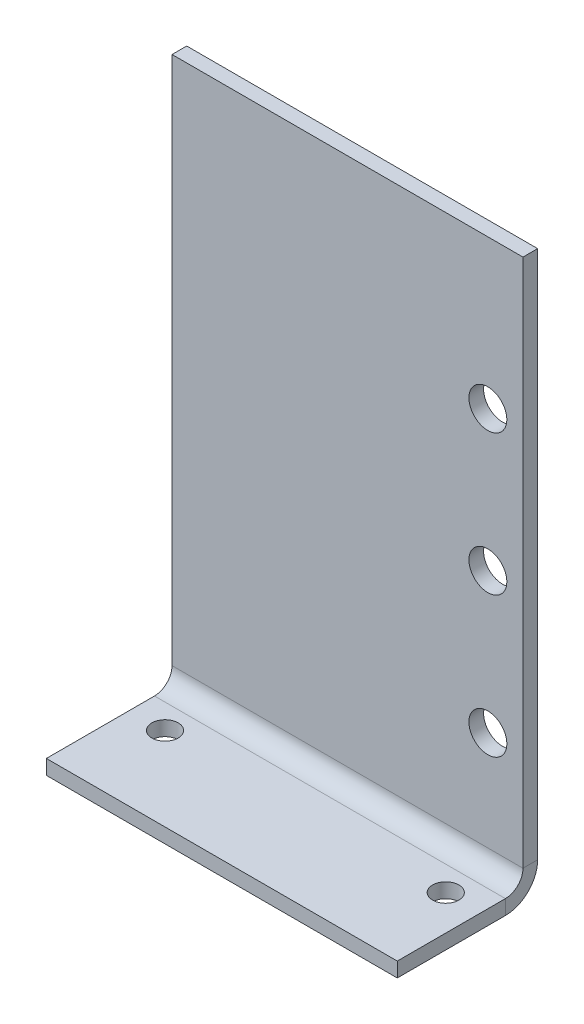
ISO-10303-21;
HEADER;
FILE_DESCRIPTION(('STEP AP214'),'2;1');
FILE_NAME('part.step','',(''),(''),'','','');
FILE_SCHEMA(('AUTOMOTIVE_DESIGN { 1 0 10303 214 1 1 1 1 }'));
ENDSEC;
DATA;
#1=APPLICATION_CONTEXT('core data for automotive mechanical design processes');
#2=APPLICATION_PROTOCOL_DEFINITION('international standard','automotive_design',2000,#1);
#3=PRODUCT_CONTEXT('',#1,'mechanical');
#4=PRODUCT('Part','Part','',(#3));
#5=PRODUCT_RELATED_PRODUCT_CATEGORY('part','',(#4));
#6=PRODUCT_DEFINITION_FORMATION('','',#4);
#7=PRODUCT_DEFINITION_CONTEXT('part definition',#1,'design');
#8=PRODUCT_DEFINITION('design','',#6,#7);
#9=PRODUCT_DEFINITION_SHAPE('','',#8);
#10=(LENGTH_UNIT() NAMED_UNIT(*) SI_UNIT(.MILLI.,.METRE.));
#11=(NAMED_UNIT(*) PLANE_ANGLE_UNIT() SI_UNIT($,.RADIAN.));
#12=(NAMED_UNIT(*) SI_UNIT($,.STERADIAN.) SOLID_ANGLE_UNIT());
#13=UNCERTAINTY_MEASURE_WITH_UNIT(LENGTH_MEASURE(1.E-05),#10,'distance_accuracy_value','');
#14=(GEOMETRIC_REPRESENTATION_CONTEXT(3) GLOBAL_UNCERTAINTY_ASSIGNED_CONTEXT((#13)) GLOBAL_UNIT_ASSIGNED_CONTEXT((#10,
#11,#12)) REPRESENTATION_CONTEXT('',''));
#15=CARTESIAN_POINT('',(0.,0.,0.));
#16=DIRECTION('',(0.,0.,1.));
#17=DIRECTION('',(1.,0.,0.));
#18=AXIS2_PLACEMENT_3D('',#15,#16,#17);
#19=CARTESIAN_POINT('',(63.5,0.,5.83184));
#20=DIRECTION('',(1.,0.,0.));
#21=DIRECTION('',(0.,0.,-1.));
#22=AXIS2_PLACEMENT_3D('',#19,#20,#21);
#23=PLANE('',#22);
#24=DIRECTION('',(0.,1.,0.));
#25=VECTOR('',#24,1.);
#26=CARTESIAN_POINT('',(63.5,0.,5.83184));
#27=LINE('',#26,#25);
#28=CARTESIAN_POINT('',(63.5,0.,5.83184));
#29=VERTEX_POINT('',#28);
#30=CARTESIAN_POINT('',(63.5,2.65684,5.83184));
#31=VERTEX_POINT('',#30);
#32=EDGE_CURVE('E11',#29,#31,#27,.T.);
#33=ORIENTED_EDGE('',*,*,#32,.F.);
#34=CARTESIAN_POINT('',(63.5,5.83184,5.83184));
#35=DIRECTION('',(1.,0.,0.));
#36=DIRECTION('',(0.,0.,-1.));
#37=AXIS2_PLACEMENT_3D('',#34,#35,#36);
#38=CIRCLE('',#37,5.83184);
#39=CARTESIAN_POINT('',(63.5,5.83184,0.));
#40=VERTEX_POINT('',#39);
#41=EDGE_CURVE('E139',#40,#29,#38,.F.);
#42=ORIENTED_EDGE('',*,*,#41,.F.);
#43=DIRECTION('',(0.,0.,-1.));
#44=VECTOR('',#43,1.);
#45=CARTESIAN_POINT('',(63.5,5.83184,2.65684));
#46=LINE('',#45,#44);
#47=CARTESIAN_POINT('',(63.5,5.83184,2.65684));
#48=VERTEX_POINT('',#47);
#49=EDGE_CURVE('E49',#48,#40,#46,.T.);
#50=ORIENTED_EDGE('',*,*,#49,.F.);
#51=CARTESIAN_POINT('',(63.5,5.83184,5.83184));
#52=DIRECTION('',(1.,0.,0.));
#53=DIRECTION('',(0.,0.,-1.));
#54=AXIS2_PLACEMENT_3D('',#51,#52,#53);
#55=CIRCLE('',#54,3.175);
#56=EDGE_CURVE('E132',#48,#31,#55,.F.);
#57=ORIENTED_EDGE('',*,*,#56,.T.);
#58=EDGE_LOOP('',(#33,#42,#50,#57));
#59=FACE_BOUND('',#58,.T.);
#60=ADVANCED_FACE('F40',(#59),#23,.T.);
#61=CARTESIAN_POINT('',(63.5,5.83184,2.65684));
#62=DIRECTION('',(1.,0.,0.));
#63=DIRECTION('',(0.,0.,-1.));
#64=AXIS2_PLACEMENT_3D('',#61,#62,#63);
#65=PLANE('',#64);
#66=DIRECTION('',(0.,0.,1.));
#67=VECTOR('',#66,1.);
#68=CARTESIAN_POINT('',(63.5,0.,0.));
#69=LINE('',#68,#67);
#70=CARTESIAN_POINT('',(63.5,0.,25.4));
#71=VERTEX_POINT('',#70);
#72=EDGE_CURVE('E200',#29,#71,#69,.T.);
#73=ORIENTED_EDGE('',*,*,#72,.F.);
#74=ORIENTED_EDGE('',*,*,#32,.T.);
#75=DIRECTION('',(0.,0.,1.));
#76=VECTOR('',#75,1.);
#77=CARTESIAN_POINT('',(63.5,2.65684,0.));
#78=LINE('',#77,#76);
#79=CARTESIAN_POINT('',(63.5,2.65684,25.4));
#80=VERTEX_POINT('',#79);
#81=EDGE_CURVE('E98',#31,#80,#78,.T.);
#82=ORIENTED_EDGE('',*,*,#81,.T.);
#83=DIRECTION('',(0.,1.,0.));
#84=VECTOR('',#83,1.);
#85=CARTESIAN_POINT('',(63.5,0.,25.4));
#86=LINE('',#85,#84);
#87=EDGE_CURVE('E197',#71,#80,#86,.T.);
#88=ORIENTED_EDGE('',*,*,#87,.F.);
#89=EDGE_LOOP('',(#73,#74,#82,#88));
#90=FACE_BOUND('',#89,.T.);
#91=ADVANCED_FACE('F220',(#90),#65,.T.);
#92=CARTESIAN_POINT('',(0.,5.83184,0.));
#93=DIRECTION('',(-1.,0.,0.));
#94=DIRECTION('',(0.,0.,1.));
#95=AXIS2_PLACEMENT_3D('',#92,#93,#94);
#96=PLANE('',#95);
#97=DIRECTION('',(0.,0.,1.));
#98=VECTOR('',#97,1.);
#99=CARTESIAN_POINT('',(0.,5.83184,0.));
#100=LINE('',#99,#98);
#101=CARTESIAN_POINT('',(0.,5.83184,0.));
#102=VERTEX_POINT('',#101);
#103=CARTESIAN_POINT('',(0.,5.83184,2.65684));
#104=VERTEX_POINT('',#103);
#105=EDGE_CURVE('E85',#102,#104,#100,.T.);
#106=ORIENTED_EDGE('',*,*,#105,.F.);
#107=CARTESIAN_POINT('',(0.,5.83184,5.83184));
#108=DIRECTION('',(1.,0.,0.));
#109=DIRECTION('',(0.,0.,-1.));
#110=AXIS2_PLACEMENT_3D('',#107,#108,#109);
#111=CIRCLE('',#110,5.83184);
#112=CARTESIAN_POINT('',(0.,0.,5.83184));
#113=VERTEX_POINT('',#112);
#114=EDGE_CURVE('E154',#102,#113,#111,.F.);
#115=ORIENTED_EDGE('',*,*,#114,.T.);
#116=DIRECTION('',(0.,-1.,0.));
#117=VECTOR('',#116,1.);
#118=CARTESIAN_POINT('',(0.,2.65684,5.83184));
#119=LINE('',#118,#117);
#120=CARTESIAN_POINT('',(0.,2.65684,5.83184));
#121=VERTEX_POINT('',#120);
#122=EDGE_CURVE('E92',#121,#113,#119,.T.);
#123=ORIENTED_EDGE('',*,*,#122,.F.);
#124=CARTESIAN_POINT('',(0.,5.83184,5.83184));
#125=DIRECTION('',(1.,0.,0.));
#126=DIRECTION('',(0.,0.,-1.));
#127=AXIS2_PLACEMENT_3D('',#124,#125,#126);
#128=CIRCLE('',#127,3.175);
#129=EDGE_CURVE('E161',#104,#121,#128,.F.);
#130=ORIENTED_EDGE('',*,*,#129,.F.);
#131=EDGE_LOOP('',(#106,#115,#123,#130));
#132=FACE_BOUND('',#131,.T.);
#133=ADVANCED_FACE('F218',(#132),#96,.T.);
#134=CARTESIAN_POINT('',(0.,2.65684,5.83184));
#135=DIRECTION('',(-1.,0.,0.));
#136=DIRECTION('',(0.,0.,1.));
#137=AXIS2_PLACEMENT_3D('',#134,#135,#136);
#138=PLANE('',#137);
#139=DIRECTION('',(0.,-1.,0.));
#140=VECTOR('',#139,1.);
#141=CARTESIAN_POINT('',(0.,0.,0.));
#142=LINE('',#141,#140);
#143=CARTESIAN_POINT('',(0.,101.6,0.));
#144=VERTEX_POINT('',#143);
#145=EDGE_CURVE('E156',#144,#102,#142,.T.);
#146=ORIENTED_EDGE('',*,*,#145,.T.);
#147=ORIENTED_EDGE('',*,*,#105,.T.);
#148=DIRECTION('',(0.,1.,0.));
#149=VECTOR('',#148,1.);
#150=CARTESIAN_POINT('',(0.,0.,2.65684));
#151=LINE('',#150,#149);
#152=CARTESIAN_POINT('',(0.,101.6,2.65684));
#153=VERTEX_POINT('',#152);
#154=EDGE_CURVE('E159',#153,#104,#151,.F.);
#155=ORIENTED_EDGE('',*,*,#154,.F.);
#156=DIRECTION('',(0.,0.,-1.));
#157=VECTOR('',#156,1.);
#158=CARTESIAN_POINT('',(0.,101.6,2.65684));
#159=LINE('',#158,#157);
#160=EDGE_CURVE('E120',#153,#144,#159,.T.);
#161=ORIENTED_EDGE('',*,*,#160,.T.);
#162=EDGE_LOOP('',(#146,#147,#155,#161));
#163=FACE_BOUND('',#162,.T.);
#164=ADVANCED_FACE('F214',(#163),#138,.T.);
#165=CARTESIAN_POINT('',(63.5,2.65684,0.));
#166=DIRECTION('',(0.,-1.,0.));
#167=DIRECTION('',(0.,0.,-1.));
#168=AXIS2_PLACEMENT_3D('',#165,#166,#167);
#169=PLANE('',#168);
#170=CARTESIAN_POINT('',(6.35,2.65684,10.27684));
#171=DIRECTION('',(0.,1.,0.));
#172=DIRECTION('',(0.,0.,1.));
#173=AXIS2_PLACEMENT_3D('',#170,#171,#172);
#174=CIRCLE('',#173,2.38125);
#175=CARTESIAN_POINT('',(6.35,2.65684,12.65809));
#176=VERTEX_POINT('',#175);
#177=EDGE_CURVE('E181',#176,#176,#174,.T.);
#178=ORIENTED_EDGE('',*,*,#177,.F.);
#179=EDGE_LOOP('',(#178));
#180=FACE_BOUND('',#179,.T.);
#181=CARTESIAN_POINT('',(57.15,2.65684,10.27684));
#182=DIRECTION('',(0.,1.,0.));
#183=DIRECTION('',(0.,0.,1.));
#184=AXIS2_PLACEMENT_3D('',#181,#182,#183);
#185=CIRCLE('',#184,2.38125);
#186=CARTESIAN_POINT('',(57.15,2.65684,12.65809));
#187=VERTEX_POINT('',#186);
#188=EDGE_CURVE('E186',#187,#187,#185,.T.);
#189=ORIENTED_EDGE('',*,*,#188,.F.);
#190=EDGE_LOOP('',(#189));
#191=FACE_BOUND('',#190,.T.);
#192=DIRECTION('',(0.,0.,1.));
#193=VECTOR('',#192,1.);
#194=CARTESIAN_POINT('',(0.,2.65684,0.));
#195=LINE('',#194,#193);
#196=CARTESIAN_POINT('',(0.,2.65684,25.4));
#197=VERTEX_POINT('',#196);
#198=EDGE_CURVE('E145',#121,#197,#195,.T.);
#199=ORIENTED_EDGE('',*,*,#198,.T.);
#200=DIRECTION('',(-1.,0.,0.));
#201=VECTOR('',#200,1.);
#202=CARTESIAN_POINT('',(63.5,2.65684,25.4));
#203=LINE('',#202,#201);
#204=EDGE_CURVE('E175',#80,#197,#203,.T.);
#205=ORIENTED_EDGE('',*,*,#204,.F.);
#206=ORIENTED_EDGE('',*,*,#81,.F.);
#207=DIRECTION('',(-1.,0.,0.));
#208=VECTOR('',#207,1.);
#209=CARTESIAN_POINT('',(63.5,2.65684,5.83184));
#210=LINE('',#209,#208);
#211=EDGE_CURVE('E144',#31,#121,#210,.T.);
#212=ORIENTED_EDGE('',*,*,#211,.T.);
#213=EDGE_LOOP('',(#199,#205,#206,#212));
#214=FACE_BOUND('',#213,.T.);
#215=ADVANCED_FACE('F226',(#180,#191,#214),#169,.F.);
#216=CARTESIAN_POINT('',(63.5,0.,25.4));
#217=DIRECTION('',(0.,0.,1.));
#218=DIRECTION('',(1.,0.,0.));
#219=AXIS2_PLACEMENT_3D('',#216,#217,#218);
#220=PLANE('',#219);
#221=DIRECTION('',(0.,1.,0.));
#222=VECTOR('',#221,1.);
#223=CARTESIAN_POINT('',(0.,0.,25.4));
#224=LINE('',#223,#222);
#225=CARTESIAN_POINT('',(0.,0.,25.4));
#226=VERTEX_POINT('',#225);
#227=EDGE_CURVE('E148',#226,#197,#224,.T.);
#228=ORIENTED_EDGE('',*,*,#227,.F.);
#229=DIRECTION('',(-1.,0.,0.));
#230=VECTOR('',#229,1.);
#231=CARTESIAN_POINT('',(63.5,0.,25.4));
#232=LINE('',#231,#230);
#233=EDGE_CURVE('E173',#71,#226,#232,.T.);
#234=ORIENTED_EDGE('',*,*,#233,.F.);
#235=ORIENTED_EDGE('',*,*,#87,.T.);
#236=ORIENTED_EDGE('',*,*,#204,.T.);
#237=EDGE_LOOP('',(#228,#234,#235,#236));
#238=FACE_BOUND('',#237,.T.);
#239=ADVANCED_FACE('F255',(#238),#220,.T.);
#240=CARTESIAN_POINT('',(63.5,0.,0.));
#241=DIRECTION('',(0.,-1.,0.));
#242=DIRECTION('',(0.,0.,-1.));
#243=AXIS2_PLACEMENT_3D('',#240,#241,#242);
#244=PLANE('',#243);
#245=CARTESIAN_POINT('',(6.35,0.,10.27684));
#246=DIRECTION('',(0.,-1.,0.));
#247=DIRECTION('',(0.,0.,-1.));
#248=AXIS2_PLACEMENT_3D('',#245,#246,#247);
#249=CIRCLE('',#248,2.38125);
#250=CARTESIAN_POINT('',(6.35,0.,7.89559));
#251=VERTEX_POINT('',#250);
#252=EDGE_CURVE('E43',#251,#251,#249,.T.);
#253=ORIENTED_EDGE('',*,*,#252,.F.);
#254=EDGE_LOOP('',(#253));
#255=FACE_BOUND('',#254,.T.);
#256=CARTESIAN_POINT('',(57.15,0.,10.27684));
#257=DIRECTION('',(0.,-1.,0.));
#258=DIRECTION('',(0.,0.,-1.));
#259=AXIS2_PLACEMENT_3D('',#256,#257,#258);
#260=CIRCLE('',#259,2.38125);
#261=CARTESIAN_POINT('',(57.15,0.,7.89559));
#262=VERTEX_POINT('',#261);
#263=EDGE_CURVE('E179',#262,#262,#260,.T.);
#264=ORIENTED_EDGE('',*,*,#263,.F.);
#265=EDGE_LOOP('',(#264));
#266=FACE_BOUND('',#265,.T.);
#267=DIRECTION('',(0.,0.,1.));
#268=VECTOR('',#267,1.);
#269=CARTESIAN_POINT('',(0.,0.,0.));
#270=LINE('',#269,#268);
#271=EDGE_CURVE('E151',#113,#226,#270,.T.);
#272=ORIENTED_EDGE('',*,*,#271,.F.);
#273=DIRECTION('',(-1.,0.,0.));
#274=VECTOR('',#273,1.);
#275=CARTESIAN_POINT('',(63.5,0.,5.83184));
#276=LINE('',#275,#274);
#277=EDGE_CURVE('E170',#29,#113,#276,.T.);
#278=ORIENTED_EDGE('',*,*,#277,.F.);
#279=ORIENTED_EDGE('',*,*,#72,.T.);
#280=ORIENTED_EDGE('',*,*,#233,.T.);
#281=EDGE_LOOP('',(#272,#278,#279,#280));
#282=FACE_BOUND('',#281,.T.);
#283=ADVANCED_FACE('F260',(#255,#266,#282),#244,.T.);
#284=CARTESIAN_POINT('',(63.5,5.83184,5.83184));
#285=DIRECTION('',(-1.,0.,0.));
#286=DIRECTION('',(0.,0.,1.));
#287=AXIS2_PLACEMENT_3D('',#284,#285,#286);
#288=CYLINDRICAL_SURFACE('',#287,5.83184);
#289=ORIENTED_EDGE('',*,*,#114,.F.);
#290=DIRECTION('',(-1.,0.,0.));
#291=VECTOR('',#290,1.);
#292=CARTESIAN_POINT('',(63.5,5.83184,0.));
#293=LINE('',#292,#291);
#294=EDGE_CURVE('E167',#40,#102,#293,.T.);
#295=ORIENTED_EDGE('',*,*,#294,.F.);
#296=ORIENTED_EDGE('',*,*,#41,.T.);
#297=ORIENTED_EDGE('',*,*,#277,.T.);
#298=EDGE_LOOP('',(#289,#295,#296,#297));
#299=FACE_BOUND('',#298,.T.);
#300=ADVANCED_FACE('F207',(#299),#288,.T.);
#301=CARTESIAN_POINT('',(63.5,0.,0.));
#302=DIRECTION('',(0.,0.,-1.));
#303=DIRECTION('',(-1.,0.,0.));
#304=AXIS2_PLACEMENT_3D('',#301,#302,#303);
#305=PLANE('',#304);
#306=CARTESIAN_POINT('',(57.15,23.8682536755919,0.));
#307=DIRECTION('',(0.,0.,-1.));
#308=DIRECTION('',(-1.,0.,0.));
#309=AXIS2_PLACEMENT_3D('',#306,#307,#308);
#310=CIRCLE('',#309,3.43016819289943);
#311=CARTESIAN_POINT('',(53.7198318071006,23.8682536755919,0.));
#312=VERTEX_POINT('',#311);
#313=EDGE_CURVE('E191',#312,#312,#310,.T.);
#314=ORIENTED_EDGE('',*,*,#313,.F.);
#315=EDGE_LOOP('',(#314));
#316=FACE_BOUND('',#315,.T.);
#317=CARTESIAN_POINT('',(57.15,74.6682536755919,0.));
#318=DIRECTION('',(0.,0.,-1.));
#319=DIRECTION('',(-1.,0.,0.));
#320=AXIS2_PLACEMENT_3D('',#317,#318,#319);
#321=CIRCLE('',#320,3.43016819289943);
#322=CARTESIAN_POINT('',(53.7198318071006,74.6682536755919,0.));
#323=VERTEX_POINT('',#322);
#324=EDGE_CURVE('E443',#323,#323,#321,.T.);
#325=ORIENTED_EDGE('',*,*,#324,.F.);
#326=EDGE_LOOP('',(#325));
#327=FACE_BOUND('',#326,.T.);
#328=CARTESIAN_POINT('',(57.15,49.2682536755919,0.));
#329=DIRECTION('',(0.,0.,-1.));
#330=DIRECTION('',(-1.,0.,0.));
#331=AXIS2_PLACEMENT_3D('',#328,#329,#330);
#332=CIRCLE('',#331,3.43016819289943);
#333=CARTESIAN_POINT('',(53.7198318071006,49.2682536755919,0.));
#334=VERTEX_POINT('',#333);
#335=EDGE_CURVE('E441',#334,#334,#332,.T.);
#336=ORIENTED_EDGE('',*,*,#335,.F.);
#337=EDGE_LOOP('',(#336));
#338=FACE_BOUND('',#337,.T.);
#339=ORIENTED_EDGE('',*,*,#145,.F.);
#340=DIRECTION('',(-1.,0.,0.));
#341=VECTOR('',#340,1.);
#342=CARTESIAN_POINT('',(63.5,101.6,0.));
#343=LINE('',#342,#341);
#344=CARTESIAN_POINT('',(63.5,101.6,0.));
#345=VERTEX_POINT('',#344);
#346=EDGE_CURVE('E122',#345,#144,#343,.T.);
#347=ORIENTED_EDGE('',*,*,#346,.F.);
#348=DIRECTION('',(0.,-1.,0.));
#349=VECTOR('',#348,1.);
#350=CARTESIAN_POINT('',(63.5,0.,0.));
#351=LINE('',#350,#349);
#352=EDGE_CURVE('E137',#345,#40,#351,.T.);
#353=ORIENTED_EDGE('',*,*,#352,.T.);
#354=ORIENTED_EDGE('',*,*,#294,.T.);
#355=EDGE_LOOP('',(#339,#347,#353,#354));
#356=FACE_BOUND('',#355,.T.);
#357=ADVANCED_FACE('F213',(#316,#327,#338,#356),#305,.T.);
#358=CARTESIAN_POINT('',(63.5,101.6,2.65684));
#359=DIRECTION('',(0.,1.,0.));
#360=DIRECTION('',(0.,0.,1.));
#361=AXIS2_PLACEMENT_3D('',#358,#359,#360);
#362=PLANE('',#361);
#363=ORIENTED_EDGE('',*,*,#160,.F.);
#364=DIRECTION('',(-1.,0.,0.));
#365=VECTOR('',#364,1.);
#366=CARTESIAN_POINT('',(63.5,101.6,2.65684));
#367=LINE('',#366,#365);
#368=CARTESIAN_POINT('',(63.5,101.6,2.65684));
#369=VERTEX_POINT('',#368);
#370=EDGE_CURVE('E114',#369,#153,#367,.T.);
#371=ORIENTED_EDGE('',*,*,#370,.F.);
#372=DIRECTION('',(0.,0.,-1.));
#373=VECTOR('',#372,1.);
#374=CARTESIAN_POINT('',(63.5,101.6,2.65684));
#375=LINE('',#374,#373);
#376=EDGE_CURVE('E118',#369,#345,#375,.T.);
#377=ORIENTED_EDGE('',*,*,#376,.T.);
#378=ORIENTED_EDGE('',*,*,#346,.T.);
#379=EDGE_LOOP('',(#363,#371,#377,#378));
#380=FACE_BOUND('',#379,.T.);
#381=ADVANCED_FACE('F116',(#380),#362,.T.);
#382=CARTESIAN_POINT('',(63.5,0.,2.65684));
#383=DIRECTION('',(0.,0.,-1.));
#384=DIRECTION('',(-1.,0.,0.));
#385=AXIS2_PLACEMENT_3D('',#382,#383,#384);
#386=PLANE('',#385);
#387=CARTESIAN_POINT('',(57.15,23.8682536755919,2.65684));
#388=DIRECTION('',(0.,0.,1.));
#389=DIRECTION('',(1.,0.,0.));
#390=AXIS2_PLACEMENT_3D('',#387,#388,#389);
#391=CIRCLE('',#390,3.43016819289943);
#392=CARTESIAN_POINT('',(60.5801681928994,23.8682536755919,2.65684));
#393=VERTEX_POINT('',#392);
#394=EDGE_CURVE('E432',#393,#393,#391,.T.);
#395=ORIENTED_EDGE('',*,*,#394,.F.);
#396=EDGE_LOOP('',(#395));
#397=FACE_BOUND('',#396,.T.);
#398=CARTESIAN_POINT('',(57.15,74.6682536755919,2.65684));
#399=DIRECTION('',(0.,0.,1.));
#400=DIRECTION('',(1.,0.,0.));
#401=AXIS2_PLACEMENT_3D('',#398,#399,#400);
#402=CIRCLE('',#401,3.43016819289943);
#403=CARTESIAN_POINT('',(60.5801681928994,74.6682536755919,2.65684));
#404=VERTEX_POINT('',#403);
#405=EDGE_CURVE('E433',#404,#404,#402,.T.);
#406=ORIENTED_EDGE('',*,*,#405,.F.);
#407=EDGE_LOOP('',(#406));
#408=FACE_BOUND('',#407,.T.);
#409=CARTESIAN_POINT('',(57.15,49.2682536755919,2.65684));
#410=DIRECTION('',(0.,0.,1.));
#411=DIRECTION('',(1.,0.,0.));
#412=AXIS2_PLACEMENT_3D('',#409,#410,#411);
#413=CIRCLE('',#412,3.43016819289943);
#414=CARTESIAN_POINT('',(60.5801681928994,49.2682536755919,2.65684));
#415=VERTEX_POINT('',#414);
#416=EDGE_CURVE('E436',#415,#415,#413,.T.);
#417=ORIENTED_EDGE('',*,*,#416,.F.);
#418=EDGE_LOOP('',(#417));
#419=FACE_BOUND('',#418,.T.);
#420=ORIENTED_EDGE('',*,*,#154,.T.);
#421=DIRECTION('',(-1.,0.,0.));
#422=VECTOR('',#421,1.);
#423=CARTESIAN_POINT('',(63.5,5.83184,2.65684));
#424=LINE('',#423,#422);
#425=EDGE_CURVE('E123',#48,#104,#424,.T.);
#426=ORIENTED_EDGE('',*,*,#425,.F.);
#427=DIRECTION('',(0.,1.,0.));
#428=VECTOR('',#427,1.);
#429=CARTESIAN_POINT('',(63.5,0.,2.65684));
#430=LINE('',#429,#428);
#431=EDGE_CURVE('E127',#369,#48,#430,.F.);
#432=ORIENTED_EDGE('',*,*,#431,.F.);
#433=ORIENTED_EDGE('',*,*,#370,.T.);
#434=EDGE_LOOP('',(#420,#426,#432,#433));
#435=FACE_BOUND('',#434,.T.);
#436=ADVANCED_FACE('F128',(#397,#408,#419,#435),#386,.F.);
#437=CARTESIAN_POINT('',(63.5,5.83184,5.83184));
#438=DIRECTION('',(-1.,0.,0.));
#439=DIRECTION('',(0.,0.,1.));
#440=AXIS2_PLACEMENT_3D('',#437,#438,#439);
#441=CYLINDRICAL_SURFACE('',#440,3.175);
#442=ORIENTED_EDGE('',*,*,#129,.T.);
#443=ORIENTED_EDGE('',*,*,#211,.F.);
#444=ORIENTED_EDGE('',*,*,#56,.F.);
#445=ORIENTED_EDGE('',*,*,#425,.T.);
#446=EDGE_LOOP('',(#442,#443,#444,#445));
#447=FACE_BOUND('',#446,.T.);
#448=ADVANCED_FACE('F216',(#447),#441,.F.);
#449=CARTESIAN_POINT('',(63.5,5.83184,5.83184));
#450=DIRECTION('',(1.,0.,0.));
#451=DIRECTION('',(0.,0.,-1.));
#452=AXIS2_PLACEMENT_3D('',#449,#450,#451);
#453=PLANE('',#452);
#454=ORIENTED_EDGE('',*,*,#431,.T.);
#455=ORIENTED_EDGE('',*,*,#49,.T.);
#456=ORIENTED_EDGE('',*,*,#352,.F.);
#457=ORIENTED_EDGE('',*,*,#376,.F.);
#458=EDGE_LOOP('',(#454,#455,#456,#457));
#459=FACE_BOUND('',#458,.T.);
#460=ADVANCED_FACE('F135',(#459),#453,.T.);
#461=CARTESIAN_POINT('',(0.,5.83184,5.83184));
#462=DIRECTION('',(1.,0.,0.));
#463=DIRECTION('',(0.,0.,-1.));
#464=AXIS2_PLACEMENT_3D('',#461,#462,#463);
#465=PLANE('',#464);
#466=ORIENTED_EDGE('',*,*,#198,.F.);
#467=ORIENTED_EDGE('',*,*,#122,.T.);
#468=ORIENTED_EDGE('',*,*,#271,.T.);
#469=ORIENTED_EDGE('',*,*,#227,.T.);
#470=EDGE_LOOP('',(#466,#467,#468,#469));
#471=FACE_BOUND('',#470,.T.);
#472=ADVANCED_FACE('F304',(#471),#465,.F.);
#473=CARTESIAN_POINT('',(57.15,-22.74316,10.27684));
#474=DIRECTION('',(0.,1.,0.));
#475=DIRECTION('',(0.,0.,1.));
#476=AXIS2_PLACEMENT_3D('',#473,#474,#475);
#477=CYLINDRICAL_SURFACE('',#476,2.38125);
#478=ORIENTED_EDGE('',*,*,#263,.T.);
#479=EDGE_LOOP('',(#478));
#480=FACE_BOUND('',#479,.T.);
#481=ORIENTED_EDGE('',*,*,#188,.T.);
#482=EDGE_LOOP('',(#481));
#483=FACE_BOUND('',#482,.T.);
#484=ADVANCED_FACE('F314',(#480,#483),#477,.F.);
#485=CARTESIAN_POINT('',(6.35,-22.74316,10.27684));
#486=DIRECTION('',(0.,1.,0.));
#487=DIRECTION('',(0.,0.,1.));
#488=AXIS2_PLACEMENT_3D('',#485,#486,#487);
#489=CYLINDRICAL_SURFACE('',#488,2.38125);
#490=ORIENTED_EDGE('',*,*,#252,.T.);
#491=EDGE_LOOP('',(#490));
#492=FACE_BOUND('',#491,.T.);
#493=ORIENTED_EDGE('',*,*,#177,.T.);
#494=EDGE_LOOP('',(#493));
#495=FACE_BOUND('',#494,.T.);
#496=ADVANCED_FACE('F341',(#492,#495),#489,.F.);
#497=CARTESIAN_POINT('',(57.15,49.2682536755919,-22.74316));
#498=DIRECTION('',(0.,0.,1.));
#499=DIRECTION('',(1.,0.,0.));
#500=AXIS2_PLACEMENT_3D('',#497,#498,#499);
#501=CYLINDRICAL_SURFACE('',#500,3.43016819289943);
#502=ORIENTED_EDGE('',*,*,#335,.T.);
#503=EDGE_LOOP('',(#502));
#504=FACE_BOUND('',#503,.T.);
#505=ORIENTED_EDGE('',*,*,#416,.T.);
#506=EDGE_LOOP('',(#505));
#507=FACE_BOUND('',#506,.T.);
#508=ADVANCED_FACE('F351',(#504,#507),#501,.F.);
#509=CARTESIAN_POINT('',(57.15,74.6682536755919,-22.74316));
#510=DIRECTION('',(0.,0.,1.));
#511=DIRECTION('',(1.,0.,0.));
#512=AXIS2_PLACEMENT_3D('',#509,#510,#511);
#513=CYLINDRICAL_SURFACE('',#512,3.43016819289943);
#514=ORIENTED_EDGE('',*,*,#324,.T.);
#515=EDGE_LOOP('',(#514));
#516=FACE_BOUND('',#515,.T.);
#517=ORIENTED_EDGE('',*,*,#405,.T.);
#518=EDGE_LOOP('',(#517));
#519=FACE_BOUND('',#518,.T.);
#520=ADVANCED_FACE('F378',(#516,#519),#513,.F.);
#521=CARTESIAN_POINT('',(57.15,23.8682536755919,-22.74316));
#522=DIRECTION('',(0.,0.,1.));
#523=DIRECTION('',(1.,0.,0.));
#524=AXIS2_PLACEMENT_3D('',#521,#522,#523);
#525=CYLINDRICAL_SURFACE('',#524,3.43016819289943);
#526=ORIENTED_EDGE('',*,*,#313,.T.);
#527=EDGE_LOOP('',(#526));
#528=FACE_BOUND('',#527,.T.);
#529=ORIENTED_EDGE('',*,*,#394,.T.);
#530=EDGE_LOOP('',(#529));
#531=FACE_BOUND('',#530,.T.);
#532=ADVANCED_FACE('F389',(#528,#531),#525,.F.);
#533=CLOSED_SHELL('',(#60,#91,#133,#164,#215,#239,#283,#300,#357,#381,#436,#448,#460,#472,#484,
#496,#508,#520,#532));
#534=MANIFOLD_SOLID_BREP('B2',#533);
#535=ADVANCED_BREP_SHAPE_REPRESENTATION('',(#18,#534),#14);
#536=SHAPE_DEFINITION_REPRESENTATION(#9,#535);
ENDSEC;
END-ISO-10303-21;
